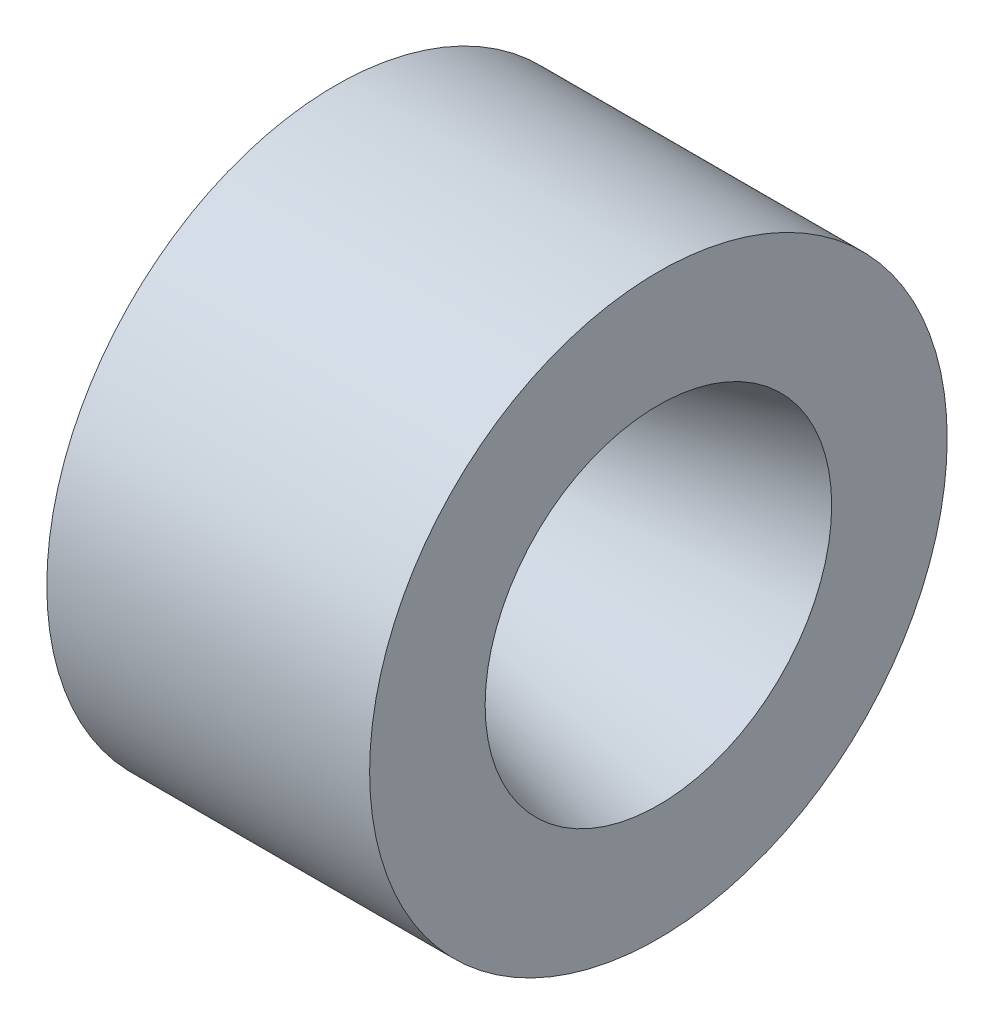
ISO-10303-21;
HEADER;
FILE_DESCRIPTION(('STEP AP214'),'2;1');
FILE_NAME('part.step','',(''),(''),'','','');
FILE_SCHEMA(('AUTOMOTIVE_DESIGN { 1 0 10303 214 1 1 1 1 }'));
ENDSEC;
DATA;
#1=APPLICATION_CONTEXT('core data for automotive mechanical design processes');
#2=APPLICATION_PROTOCOL_DEFINITION('international standard','automotive_design',2000,#1);
#3=PRODUCT_CONTEXT('',#1,'mechanical');
#4=PRODUCT('Part','Part','',(#3));
#5=PRODUCT_RELATED_PRODUCT_CATEGORY('part','',(#4));
#6=PRODUCT_DEFINITION_FORMATION('','',#4);
#7=PRODUCT_DEFINITION_CONTEXT('part definition',#1,'design');
#8=PRODUCT_DEFINITION('design','',#6,#7);
#9=PRODUCT_DEFINITION_SHAPE('','',#8);
#10=(LENGTH_UNIT() NAMED_UNIT(*) SI_UNIT(.MILLI.,.METRE.));
#11=(NAMED_UNIT(*) PLANE_ANGLE_UNIT() SI_UNIT($,.RADIAN.));
#12=(NAMED_UNIT(*) SI_UNIT($,.STERADIAN.) SOLID_ANGLE_UNIT());
#13=UNCERTAINTY_MEASURE_WITH_UNIT(LENGTH_MEASURE(1.E-05),#10,'distance_accuracy_value','');
#14=(GEOMETRIC_REPRESENTATION_CONTEXT(3) GLOBAL_UNCERTAINTY_ASSIGNED_CONTEXT((#13)) GLOBAL_UNIT_ASSIGNED_CONTEXT((#10,
#11,#12)) REPRESENTATION_CONTEXT('',''));
#15=CARTESIAN_POINT('',(0.,0.,0.));
#16=DIRECTION('',(0.,0.,1.));
#17=DIRECTION('',(1.,0.,0.));
#18=AXIS2_PLACEMENT_3D('',#15,#16,#17);
#19=CARTESIAN_POINT('',(152.4,44.45,0.));
#20=DIRECTION('',(-1.,0.,0.));
#21=DIRECTION('',(0.,0.,1.));
#22=AXIS2_PLACEMENT_3D('',#19,#20,#21);
#23=PLANE('',#22);
#24=CARTESIAN_POINT('',(152.4,0.,0.));
#25=DIRECTION('',(-1.,0.,0.));
#26=DIRECTION('',(0.,0.,1.));
#27=AXIS2_PLACEMENT_3D('',#24,#25,#26);
#28=CIRCLE('',#27,37.338);
#29=CARTESIAN_POINT('',(152.4,0.,37.338));
#30=VERTEX_POINT('',#29);
#31=EDGE_CURVE('E62',#30,#30,#28,.T.);
#32=ORIENTED_EDGE('',*,*,#31,.T.);
#33=EDGE_LOOP('',(#32));
#34=FACE_BOUND('',#33,.T.);
#35=CARTESIAN_POINT('',(152.4,0.,0.));
#36=DIRECTION('',(1.,0.,0.));
#37=DIRECTION('',(0.,0.,-1.));
#38=AXIS2_PLACEMENT_3D('',#35,#36,#37);
#39=CIRCLE('',#38,34.925);
#40=CARTESIAN_POINT('',(152.4,0.,-34.925));
#41=VERTEX_POINT('',#40);
#42=EDGE_CURVE('E51',#41,#41,#39,.T.);
#43=ORIENTED_EDGE('',*,*,#42,.T.);
#44=EDGE_LOOP('',(#43));
#45=FACE_BOUND('',#44,.T.);
#46=ADVANCED_FACE('F36',(#34,#45),#23,.T.);
#47=CARTESIAN_POINT('',(152.4,0.,0.));
#48=DIRECTION('',(1.,0.,0.));
#49=DIRECTION('',(0.,0.,-1.));
#50=AXIS2_PLACEMENT_3D('',#47,#48,#49);
#51=CYLINDRICAL_SURFACE('',#50,44.45);
#52=CARTESIAN_POINT('',(152.4,0.,0.));
#53=DIRECTION('',(1.,0.,0.));
#54=DIRECTION('',(0.,0.,-1.));
#55=AXIS2_PLACEMENT_3D('',#52,#53,#54);
#56=CIRCLE('',#55,44.45);
#57=CARTESIAN_POINT('',(152.4,0.,-44.45));
#58=VERTEX_POINT('',#57);
#59=EDGE_CURVE('E47',#58,#58,#56,.T.);
#60=ORIENTED_EDGE('',*,*,#59,.T.);
#61=EDGE_LOOP('',(#60));
#62=FACE_BOUND('',#61,.T.);
#63=CARTESIAN_POINT('',(202.086164401204,0.,0.));
#64=DIRECTION('',(1.,0.,0.));
#65=DIRECTION('',(0.,0.,-1.));
#66=AXIS2_PLACEMENT_3D('',#63,#64,#65);
#67=CIRCLE('',#66,44.45);
#68=CARTESIAN_POINT('',(202.086164401204,0.,-44.45));
#69=VERTEX_POINT('',#68);
#70=EDGE_CURVE('E59',#69,#69,#67,.T.);
#71=ORIENTED_EDGE('',*,*,#70,.F.);
#72=EDGE_LOOP('',(#71));
#73=FACE_BOUND('',#72,.T.);
#74=ADVANCED_FACE('F88',(#62,#73),#51,.T.);
#75=CARTESIAN_POINT('',(152.4,0.,0.));
#76=DIRECTION('',(-1.,0.,0.));
#77=DIRECTION('',(0.,0.,1.));
#78=AXIS2_PLACEMENT_3D('',#75,#76,#77);
#79=CIRCLE('',#78,41.4274);
#80=CARTESIAN_POINT('',(152.4,0.,41.4274));
#81=VERTEX_POINT('',#80);
#82=EDGE_CURVE('E77',#81,#81,#79,.T.);
#83=ORIENTED_EDGE('',*,*,#82,.F.);
#84=EDGE_LOOP('',(#83));
#85=FACE_BOUND('',#84,.T.);
#86=ORIENTED_EDGE('',*,*,#59,.F.);
#87=EDGE_LOOP('',(#86));
#88=FACE_BOUND('',#87,.T.);
#89=ADVANCED_FACE('F84',(#85,#88),#23,.T.);
#90=CARTESIAN_POINT('',(152.4,0.,0.));
#91=DIRECTION('',(-1.,0.,0.));
#92=DIRECTION('',(0.,0.,1.));
#93=AXIS2_PLACEMENT_3D('',#90,#91,#92);
#94=CONICAL_SURFACE('',#93,34.925,0.959931088596883);
#95=CARTESIAN_POINT('',(164.606408469946,0.,0.));
#96=DIRECTION('',(1.,0.,0.));
#97=DIRECTION('',(0.,0.,-1.));
#98=AXIS2_PLACEMENT_3D('',#95,#96,#97);
#99=CIRCLE('',#98,17.4924420741658);
#100=CARTESIAN_POINT('',(164.606408469946,0.,-17.4924420741658));
#101=VERTEX_POINT('',#100);
#102=EDGE_CURVE('E43',#101,#101,#99,.T.);
#103=ORIENTED_EDGE('',*,*,#102,.T.);
#104=EDGE_LOOP('',(#103));
#105=FACE_BOUND('',#104,.T.);
#106=ORIENTED_EDGE('',*,*,#42,.F.);
#107=EDGE_LOOP('',(#106));
#108=FACE_BOUND('',#107,.T.);
#109=ADVANCED_FACE('F87',(#105,#108),#94,.F.);
#110=CARTESIAN_POINT('',(165.116469101427,0.,0.));
#111=DIRECTION('',(1.,0.,0.));
#112=DIRECTION('',(0.,0.,-1.));
#113=AXIS2_PLACEMENT_3D('',#110,#111,#112);
#114=CONICAL_SURFACE('',#113,16.764,0.26179938779915);
#115=CARTESIAN_POINT('',(165.975431753474,0.,0.));
#116=DIRECTION('',(-1.,0.,0.));
#117=DIRECTION('',(0.,0.,1.));
#118=AXIS2_PLACEMENT_3D('',#115,#116,#117);
#119=CIRCLE('',#118,16.9941583489445);
#120=CARTESIAN_POINT('',(165.975431753474,0.,16.9941583489445));
#121=VERTEX_POINT('',#120);
#122=EDGE_CURVE('E10',#121,#121,#119,.T.);
#123=ORIENTED_EDGE('',*,*,#122,.T.);
#124=EDGE_LOOP('',(#123));
#125=FACE_BOUND('',#124,.T.);
#126=CARTESIAN_POINT('',(202.086164401204,0.,0.));
#127=DIRECTION('',(1.,0.,0.));
#128=DIRECTION('',(0.,0.,-1.));
#129=AXIS2_PLACEMENT_3D('',#126,#127,#128);
#130=CIRCLE('',#129,26.67);
#131=CARTESIAN_POINT('',(202.086164401204,0.,-26.67));
#132=VERTEX_POINT('',#131);
#133=EDGE_CURVE('E56',#132,#132,#130,.T.);
#134=ORIENTED_EDGE('',*,*,#133,.T.);
#135=EDGE_LOOP('',(#134));
#136=FACE_BOUND('',#135,.T.);
#137=ADVANCED_FACE('F99',(#125,#136),#114,.F.);
#138=CARTESIAN_POINT('',(202.086164401204,26.67,0.));
#139=DIRECTION('',(1.,0.,0.));
#140=DIRECTION('',(0.,0.,-1.));
#141=AXIS2_PLACEMENT_3D('',#138,#139,#140);
#142=PLANE('',#141);
#143=ORIENTED_EDGE('',*,*,#70,.T.);
#144=EDGE_LOOP('',(#143));
#145=FACE_BOUND('',#144,.T.);
#146=ORIENTED_EDGE('',*,*,#133,.F.);
#147=EDGE_LOOP('',(#146));
#148=FACE_BOUND('',#147,.T.);
#149=ADVANCED_FACE('F96',(#145,#148),#142,.T.);
#150=CARTESIAN_POINT('',(165.646731566193,0.,0.));
#151=DIRECTION('',(-1.,0.,0.));
#152=DIRECTION('',(0.,0.,1.));
#153=AXIS2_PLACEMENT_3D('',#150,#151,#152);
#154=TOROIDAL_SURFACE('',#153,18.2208841483317,1.27);
#155=ORIENTED_EDGE('',*,*,#122,.F.);
#156=EDGE_LOOP('',(#155));
#157=FACE_BOUND('',#156,.T.);
#158=ORIENTED_EDGE('',*,*,#102,.F.);
#159=EDGE_LOOP('',(#158));
#160=FACE_BOUND('',#159,.T.);
#161=ADVANCED_FACE('F38',(#157,#160),#154,.T.);
#162=CARTESIAN_POINT('',(0.,0.,0.));
#163=DIRECTION('',(-1.,0.,0.));
#164=DIRECTION('',(0.,0.,1.));
#165=AXIS2_PLACEMENT_3D('',#162,#163,#164);
#166=CYLINDRICAL_SURFACE('',#165,37.338);
#167=CARTESIAN_POINT('',(154.5336,0.,0.));
#168=DIRECTION('',(-1.,0.,0.));
#169=DIRECTION('',(0.,0.,1.));
#170=AXIS2_PLACEMENT_3D('',#167,#168,#169);
#171=CIRCLE('',#170,37.338);
#172=CARTESIAN_POINT('',(154.5336,0.,37.338));
#173=VERTEX_POINT('',#172);
#174=EDGE_CURVE('E65',#173,#173,#171,.T.);
#175=ORIENTED_EDGE('',*,*,#174,.T.);
#176=EDGE_LOOP('',(#175));
#177=FACE_BOUND('',#176,.T.);
#178=ORIENTED_EDGE('',*,*,#31,.F.);
#179=EDGE_LOOP('',(#178));
#180=FACE_BOUND('',#179,.T.);
#181=ADVANCED_FACE('F118',(#177,#180),#166,.T.);
#182=CARTESIAN_POINT('',(154.5336,0.,0.));
#183=DIRECTION('',(-1.,0.,0.));
#184=DIRECTION('',(0.,0.,1.));
#185=AXIS2_PLACEMENT_3D('',#182,#183,#184);
#186=TOROIDAL_SURFACE('',#185,37.846,0.507999999999995);
#187=CARTESIAN_POINT('',(155.0416,0.,0.));
#188=DIRECTION('',(-1.,0.,0.));
#189=DIRECTION('',(0.,0.,1.));
#190=AXIS2_PLACEMENT_3D('',#187,#188,#189);
#191=CIRCLE('',#190,37.846);
#192=CARTESIAN_POINT('',(155.0416,0.,37.846));
#193=VERTEX_POINT('',#192);
#194=EDGE_CURVE('E68',#193,#193,#191,.T.);
#195=ORIENTED_EDGE('',*,*,#194,.T.);
#196=EDGE_LOOP('',(#195));
#197=FACE_BOUND('',#196,.T.);
#198=ORIENTED_EDGE('',*,*,#174,.F.);
#199=EDGE_LOOP('',(#198));
#200=FACE_BOUND('',#199,.T.);
#201=ADVANCED_FACE('F120',(#197,#200),#186,.F.);
#202=CARTESIAN_POINT('',(155.0416,40.9194,0.));
#203=DIRECTION('',(-1.,0.,0.));
#204=DIRECTION('',(0.,0.,1.));
#205=AXIS2_PLACEMENT_3D('',#202,#203,#204);
#206=PLANE('',#205);
#207=CARTESIAN_POINT('',(155.0416,0.,0.));
#208=DIRECTION('',(-1.,0.,0.));
#209=DIRECTION('',(0.,0.,1.));
#210=AXIS2_PLACEMENT_3D('',#207,#208,#209);
#211=CIRCLE('',#210,40.9194);
#212=CARTESIAN_POINT('',(155.0416,0.,40.9194));
#213=VERTEX_POINT('',#212);
#214=EDGE_CURVE('E71',#213,#213,#211,.T.);
#215=ORIENTED_EDGE('',*,*,#214,.T.);
#216=EDGE_LOOP('',(#215));
#217=FACE_BOUND('',#216,.T.);
#218=ORIENTED_EDGE('',*,*,#194,.F.);
#219=EDGE_LOOP('',(#218));
#220=FACE_BOUND('',#219,.T.);
#221=ADVANCED_FACE('F127',(#217,#220),#206,.T.);
#222=CARTESIAN_POINT('',(154.5336,0.,0.));
#223=DIRECTION('',(-1.,0.,0.));
#224=DIRECTION('',(0.,0.,1.));
#225=AXIS2_PLACEMENT_3D('',#222,#223,#224);
#226=TOROIDAL_SURFACE('',#225,40.9194,0.507999999999995);
#227=CARTESIAN_POINT('',(154.5336,0.,0.));
#228=DIRECTION('',(-1.,0.,0.));
#229=DIRECTION('',(0.,0.,1.));
#230=AXIS2_PLACEMENT_3D('',#227,#228,#229);
#231=CIRCLE('',#230,41.4274);
#232=CARTESIAN_POINT('',(154.5336,0.,41.4274));
#233=VERTEX_POINT('',#232);
#234=EDGE_CURVE('E74',#233,#233,#231,.T.);
#235=ORIENTED_EDGE('',*,*,#234,.T.);
#236=EDGE_LOOP('',(#235));
#237=FACE_BOUND('',#236,.T.);
#238=ORIENTED_EDGE('',*,*,#214,.F.);
#239=EDGE_LOOP('',(#238));
#240=FACE_BOUND('',#239,.T.);
#241=ADVANCED_FACE('F134',(#237,#240),#226,.F.);
#242=CARTESIAN_POINT('',(0.,0.,0.));
#243=DIRECTION('',(-1.,0.,0.));
#244=DIRECTION('',(0.,0.,1.));
#245=AXIS2_PLACEMENT_3D('',#242,#243,#244);
#246=CYLINDRICAL_SURFACE('',#245,41.4274);
#247=ORIENTED_EDGE('',*,*,#82,.T.);
#248=EDGE_LOOP('',(#247));
#249=FACE_BOUND('',#248,.T.);
#250=ORIENTED_EDGE('',*,*,#234,.F.);
#251=EDGE_LOOP('',(#250));
#252=FACE_BOUND('',#251,.T.);
#253=ADVANCED_FACE('F81',(#249,#252),#246,.F.);
#254=CLOSED_SHELL('',(#46,#74,#89,#109,#137,#149,#161,#181,#201,#221,#241,#253));
#255=MANIFOLD_SOLID_BREP('B2',#254);
#256=ADVANCED_BREP_SHAPE_REPRESENTATION('',(#18,#255),#14);
#257=SHAPE_DEFINITION_REPRESENTATION(#9,#256);
ENDSEC;
END-ISO-10303-21;
